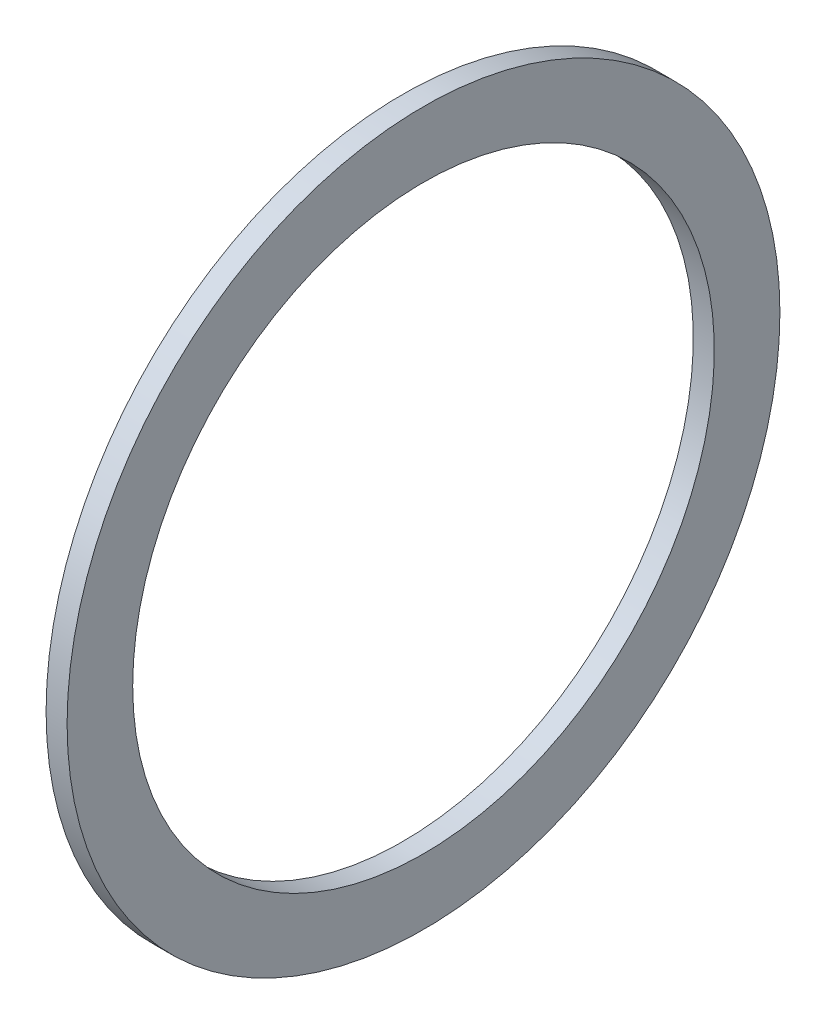
ISO-10303-21;
HEADER;
FILE_DESCRIPTION(('STEP AP214'),'2;1');
FILE_NAME('part.step','',(''),(''),'','','');
FILE_SCHEMA(('AUTOMOTIVE_DESIGN { 1 0 10303 214 1 1 1 1 }'));
ENDSEC;
DATA;
#1=APPLICATION_CONTEXT('core data for automotive mechanical design processes');
#2=APPLICATION_PROTOCOL_DEFINITION('international standard','automotive_design',2000,#1);
#3=PRODUCT_CONTEXT('',#1,'mechanical');
#4=PRODUCT('Part','Part','',(#3));
#5=PRODUCT_RELATED_PRODUCT_CATEGORY('part','',(#4));
#6=PRODUCT_DEFINITION_FORMATION('','',#4);
#7=PRODUCT_DEFINITION_CONTEXT('part definition',#1,'design');
#8=PRODUCT_DEFINITION('design','',#6,#7);
#9=PRODUCT_DEFINITION_SHAPE('','',#8);
#10=(LENGTH_UNIT() NAMED_UNIT(*) SI_UNIT(.MILLI.,.METRE.));
#11=(NAMED_UNIT(*) PLANE_ANGLE_UNIT() SI_UNIT($,.RADIAN.));
#12=(NAMED_UNIT(*) SI_UNIT($,.STERADIAN.) SOLID_ANGLE_UNIT());
#13=UNCERTAINTY_MEASURE_WITH_UNIT(LENGTH_MEASURE(1.E-05),#10,'distance_accuracy_value','');
#14=(GEOMETRIC_REPRESENTATION_CONTEXT(3) GLOBAL_UNCERTAINTY_ASSIGNED_CONTEXT((#13)) GLOBAL_UNIT_ASSIGNED_CONTEXT((#10,
#11,#12)) REPRESENTATION_CONTEXT('',''));
#15=CARTESIAN_POINT('',(0.,0.,0.));
#16=DIRECTION('',(0.,0.,1.));
#17=DIRECTION('',(1.,0.,0.));
#18=AXIS2_PLACEMENT_3D('',#15,#16,#17);
#19=CARTESIAN_POINT('',(0.,0.,0.));
#20=DIRECTION('',(-1.,0.,0.));
#21=DIRECTION('',(0.,0.,1.));
#22=AXIS2_PLACEMENT_3D('',#19,#20,#21);
#23=CYLINDRICAL_SURFACE('',#22,44.824999885);
#24=CARTESIAN_POINT('',(8.22330003799999,0.,0.));
#25=DIRECTION('',(-1.,0.,0.));
#26=DIRECTION('',(0.,0.,1.));
#27=AXIS2_PLACEMENT_3D('',#24,#25,#26);
#28=CIRCLE('',#27,44.824999885);
#29=CARTESIAN_POINT('',(8.22330003799999,0.,44.824999885));
#30=VERTEX_POINT('',#29);
#31=EDGE_CURVE('E10',#30,#30,#28,.T.);
#32=ORIENTED_EDGE('',*,*,#31,.F.);
#33=EDGE_LOOP('',(#32));
#34=FACE_BOUND('',#33,.T.);
#35=CARTESIAN_POINT('',(4.98480003799999,0.,0.));
#36=DIRECTION('',(-1.,0.,0.));
#37=DIRECTION('',(0.,0.,1.));
#38=AXIS2_PLACEMENT_3D('',#35,#36,#37);
#39=CIRCLE('',#38,44.824999885);
#40=CARTESIAN_POINT('',(4.98480003799999,0.,44.824999885));
#41=VERTEX_POINT('',#40);
#42=EDGE_CURVE('E49',#41,#41,#39,.T.);
#43=ORIENTED_EDGE('',*,*,#42,.T.);
#44=EDGE_LOOP('',(#43));
#45=FACE_BOUND('',#44,.T.);
#46=ADVANCED_FACE('F35',(#34,#45),#23,.F.);
#47=CARTESIAN_POINT('',(8.22330003799999,44.824999885,0.));
#48=DIRECTION('',(-1.,0.,0.));
#49=DIRECTION('',(0.,0.,1.));
#50=AXIS2_PLACEMENT_3D('',#47,#48,#49);
#51=PLANE('',#50);
#52=CARTESIAN_POINT('',(8.22330003799999,0.,0.));
#53=DIRECTION('',(-1.,0.,0.));
#54=DIRECTION('',(0.,0.,1.));
#55=AXIS2_PLACEMENT_3D('',#52,#53,#54);
#56=CIRCLE('',#55,54.936499982);
#57=CARTESIAN_POINT('',(8.22330003799999,0.,54.936499982));
#58=VERTEX_POINT('',#57);
#59=EDGE_CURVE('E41',#58,#58,#56,.T.);
#60=ORIENTED_EDGE('',*,*,#59,.F.);
#61=EDGE_LOOP('',(#60));
#62=FACE_BOUND('',#61,.T.);
#63=ORIENTED_EDGE('',*,*,#31,.T.);
#64=EDGE_LOOP('',(#63));
#65=FACE_BOUND('',#64,.T.);
#66=ADVANCED_FACE('F64',(#62,#65),#51,.F.);
#67=CARTESIAN_POINT('',(0.,0.,0.));
#68=DIRECTION('',(-1.,0.,0.));
#69=DIRECTION('',(0.,0.,1.));
#70=AXIS2_PLACEMENT_3D('',#67,#68,#69);
#71=CYLINDRICAL_SURFACE('',#70,54.936499982);
#72=CARTESIAN_POINT('',(4.98480003799999,0.,0.));
#73=DIRECTION('',(-1.,0.,0.));
#74=DIRECTION('',(0.,0.,1.));
#75=AXIS2_PLACEMENT_3D('',#72,#73,#74);
#76=CIRCLE('',#75,54.936499982);
#77=CARTESIAN_POINT('',(4.98480003799999,0.,54.936499982));
#78=VERTEX_POINT('',#77);
#79=EDGE_CURVE('E45',#78,#78,#76,.T.);
#80=ORIENTED_EDGE('',*,*,#79,.F.);
#81=EDGE_LOOP('',(#80));
#82=FACE_BOUND('',#81,.T.);
#83=ORIENTED_EDGE('',*,*,#59,.T.);
#84=EDGE_LOOP('',(#83));
#85=FACE_BOUND('',#84,.T.);
#86=ADVANCED_FACE('F59',(#82,#85),#71,.T.);
#87=CARTESIAN_POINT('',(4.98480003799999,54.936499982,0.));
#88=DIRECTION('',(1.,0.,0.));
#89=DIRECTION('',(0.,0.,-1.));
#90=AXIS2_PLACEMENT_3D('',#87,#88,#89);
#91=PLANE('',#90);
#92=ORIENTED_EDGE('',*,*,#42,.F.);
#93=EDGE_LOOP('',(#92));
#94=FACE_BOUND('',#93,.T.);
#95=ORIENTED_EDGE('',*,*,#79,.T.);
#96=EDGE_LOOP('',(#95));
#97=FACE_BOUND('',#96,.T.);
#98=ADVANCED_FACE('F56',(#94,#97),#91,.F.);
#99=CLOSED_SHELL('',(#46,#66,#86,#98));
#100=MANIFOLD_SOLID_BREP('B2',#99);
#101=ADVANCED_BREP_SHAPE_REPRESENTATION('',(#18,#100),#14);
#102=SHAPE_DEFINITION_REPRESENTATION(#9,#101);
ENDSEC;
END-ISO-10303-21;
